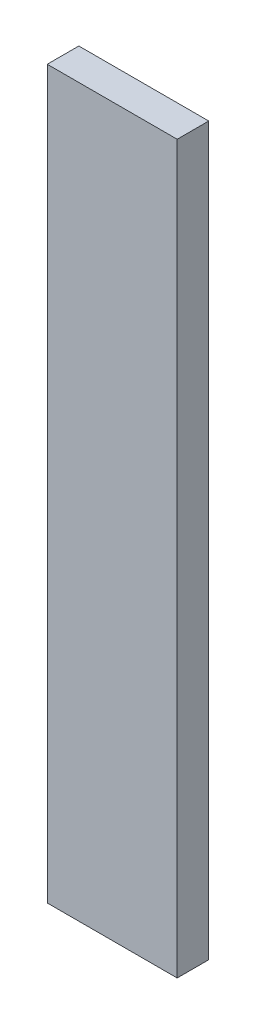
ISO-10303-21;
HEADER;
FILE_DESCRIPTION(('STEP AP214'),'2;1');
FILE_NAME('part.step','',(''),(''),'','','');
FILE_SCHEMA(('AUTOMOTIVE_DESIGN { 1 0 10303 214 1 1 1 1 }'));
ENDSEC;
DATA;
#1=APPLICATION_CONTEXT('core data for automotive mechanical design processes');
#2=APPLICATION_PROTOCOL_DEFINITION('international standard','automotive_design',2000,#1);
#3=PRODUCT_CONTEXT('',#1,'mechanical');
#4=PRODUCT('Part','Part','',(#3));
#5=PRODUCT_RELATED_PRODUCT_CATEGORY('part','',(#4));
#6=PRODUCT_DEFINITION_FORMATION('','',#4);
#7=PRODUCT_DEFINITION_CONTEXT('part definition',#1,'design');
#8=PRODUCT_DEFINITION('design','',#6,#7);
#9=PRODUCT_DEFINITION_SHAPE('','',#8);
#10=(LENGTH_UNIT() NAMED_UNIT(*) SI_UNIT(.MILLI.,.METRE.));
#11=(NAMED_UNIT(*) PLANE_ANGLE_UNIT() SI_UNIT($,.RADIAN.));
#12=(NAMED_UNIT(*) SI_UNIT($,.STERADIAN.) SOLID_ANGLE_UNIT());
#13=UNCERTAINTY_MEASURE_WITH_UNIT(LENGTH_MEASURE(1.E-05),#10,'distance_accuracy_value','');
#14=(GEOMETRIC_REPRESENTATION_CONTEXT(3) GLOBAL_UNCERTAINTY_ASSIGNED_CONTEXT((#13)) GLOBAL_UNIT_ASSIGNED_CONTEXT((#10,
#11,#12)) REPRESENTATION_CONTEXT('',''));
#15=CARTESIAN_POINT('',(0.,0.,0.));
#16=DIRECTION('',(0.,0.,1.));
#17=DIRECTION('',(1.,0.,0.));
#18=AXIS2_PLACEMENT_3D('',#15,#16,#17);
#19=CARTESIAN_POINT('',(0.,-506.,22.));
#20=DIRECTION('',(0.,1.,0.));
#21=DIRECTION('',(0.,0.,1.));
#22=AXIS2_PLACEMENT_3D('',#19,#20,#21);
#23=PLANE('',#22);
#24=DIRECTION('',(1.,0.,0.));
#25=VECTOR('',#24,1.);
#26=CARTESIAN_POINT('',(0.,-506.,0.));
#27=LINE('',#26,#25);
#28=CARTESIAN_POINT('',(0.,-506.,0.));
#29=VERTEX_POINT('',#28);
#30=CARTESIAN_POINT('',(90.4999999999996,-506.,0.));
#31=VERTEX_POINT('',#30);
#32=EDGE_CURVE('E141',#29,#31,#27,.T.);
#33=ORIENTED_EDGE('',*,*,#32,.T.);
#34=DIRECTION('',(0.,0.,-1.));
#35=VECTOR('',#34,1.);
#36=CARTESIAN_POINT('',(90.4999999999996,-506.,22.));
#37=LINE('',#36,#35);
#38=CARTESIAN_POINT('',(90.4999999999996,-506.,22.));
#39=VERTEX_POINT('',#38);
#40=EDGE_CURVE('E11',#39,#31,#37,.T.);
#41=ORIENTED_EDGE('',*,*,#40,.F.);
#42=DIRECTION('',(1.,0.,0.));
#43=VECTOR('',#42,1.);
#44=CARTESIAN_POINT('',(0.,-506.,22.));
#45=LINE('',#44,#43);
#46=CARTESIAN_POINT('',(0.,-506.,22.));
#47=VERTEX_POINT('',#46);
#48=EDGE_CURVE('E133',#47,#39,#45,.T.);
#49=ORIENTED_EDGE('',*,*,#48,.F.);
#50=DIRECTION('',(0.,0.,-1.));
#51=VECTOR('',#50,1.);
#52=CARTESIAN_POINT('',(0.,-506.,22.));
#53=LINE('',#52,#51);
#54=EDGE_CURVE('E57',#47,#29,#53,.T.);
#55=ORIENTED_EDGE('',*,*,#54,.T.);
#56=EDGE_LOOP('',(#33,#41,#49,#55));
#57=FACE_BOUND('',#56,.T.);
#58=ADVANCED_FACE('F34',(#57),#23,.F.);
#59=CARTESIAN_POINT('',(90.4999999999996,-506.,22.));
#60=DIRECTION('',(-1.,0.,0.));
#61=DIRECTION('',(0.,0.,1.));
#62=AXIS2_PLACEMENT_3D('',#59,#60,#61);
#63=PLANE('',#62);
#64=DIRECTION('',(0.,1.,0.));
#65=VECTOR('',#64,1.);
#66=CARTESIAN_POINT('',(90.4999999999996,-506.,0.));
#67=LINE('',#66,#65);
#68=CARTESIAN_POINT('',(90.4999999999996,1.11022302462516E-13,0.));
#69=VERTEX_POINT('',#68);
#70=EDGE_CURVE('E143',#31,#69,#67,.T.);
#71=ORIENTED_EDGE('',*,*,#70,.T.);
#72=DIRECTION('',(0.,0.,-1.));
#73=VECTOR('',#72,1.);
#74=CARTESIAN_POINT('',(90.4999999999996,1.11022302462516E-13,22.));
#75=LINE('',#74,#73);
#76=CARTESIAN_POINT('',(90.4999999999996,1.11022302462516E-13,22.));
#77=VERTEX_POINT('',#76);
#78=EDGE_CURVE('E41',#77,#69,#75,.T.);
#79=ORIENTED_EDGE('',*,*,#78,.F.);
#80=DIRECTION('',(0.,1.,0.));
#81=VECTOR('',#80,1.);
#82=CARTESIAN_POINT('',(90.4999999999996,-506.,22.));
#83=LINE('',#82,#81);
#84=EDGE_CURVE('E83',#39,#77,#83,.T.);
#85=ORIENTED_EDGE('',*,*,#84,.F.);
#86=ORIENTED_EDGE('',*,*,#40,.T.);
#87=EDGE_LOOP('',(#71,#79,#85,#86));
#88=FACE_BOUND('',#87,.T.);
#89=ADVANCED_FACE('F159',(#88),#63,.F.);
#90=CARTESIAN_POINT('',(0.,0.,22.));
#91=DIRECTION('',(0.,1.,0.));
#92=DIRECTION('',(-1.,0.,0.));
#93=AXIS2_PLACEMENT_3D('',#90,#91,#92);
#94=PLANE('',#93);
#95=DIRECTION('',(1.,0.,0.));
#96=VECTOR('',#95,1.);
#97=CARTESIAN_POINT('',(0.,0.,0.));
#98=LINE('',#97,#96);
#99=CARTESIAN_POINT('',(0.,0.,0.));
#100=VERTEX_POINT('',#99);
#101=EDGE_CURVE('E147',#100,#69,#98,.T.);
#102=ORIENTED_EDGE('',*,*,#101,.F.);
#103=DIRECTION('',(0.,0.,-1.));
#104=VECTOR('',#103,1.);
#105=CARTESIAN_POINT('',(0.,0.,22.));
#106=LINE('',#105,#104);
#107=CARTESIAN_POINT('',(0.,0.,22.));
#108=VERTEX_POINT('',#107);
#109=EDGE_CURVE('E153',#108,#100,#106,.T.);
#110=ORIENTED_EDGE('',*,*,#109,.F.);
#111=DIRECTION('',(1.,0.,0.));
#112=VECTOR('',#111,1.);
#113=CARTESIAN_POINT('',(0.,0.,22.));
#114=LINE('',#113,#112);
#115=EDGE_CURVE('E136',#108,#77,#114,.T.);
#116=ORIENTED_EDGE('',*,*,#115,.T.);
#117=ORIENTED_EDGE('',*,*,#78,.T.);
#118=EDGE_LOOP('',(#102,#110,#116,#117));
#119=FACE_BOUND('',#118,.T.);
#120=ADVANCED_FACE('F157',(#119),#94,.T.);
#121=CARTESIAN_POINT('',(0.,-506.,22.));
#122=DIRECTION('',(-1.,0.,0.));
#123=DIRECTION('',(0.,0.,1.));
#124=AXIS2_PLACEMENT_3D('',#121,#122,#123);
#125=PLANE('',#124);
#126=DIRECTION('',(0.,0.,-1.));
#127=VECTOR('',#126,1.);
#128=CARTESIAN_POINT('',(0.,-9.9999999999999,4.44089209850063E-13));
#129=LINE('',#128,#127);
#130=CARTESIAN_POINT('',(0.,-9.9999999999999,12.));
#131=VERTEX_POINT('',#130);
#132=CARTESIAN_POINT('',(0.,-9.9999999999999,4.44089209850063E-13));
#133=VERTEX_POINT('',#132);
#134=EDGE_CURVE('E122',#131,#133,#129,.T.);
#135=ORIENTED_EDGE('',*,*,#134,.F.);
#136=DIRECTION('',(0.,1.,0.));
#137=VECTOR('',#136,1.);
#138=CARTESIAN_POINT('',(0.,-9.9999999999999,12.));
#139=LINE('',#138,#137);
#140=CARTESIAN_POINT('',(0.,-496.,12.0000000000001));
#141=VERTEX_POINT('',#140);
#142=EDGE_CURVE('E170',#141,#131,#139,.T.);
#143=ORIENTED_EDGE('',*,*,#142,.F.);
#144=DIRECTION('',(0.,0.,1.));
#145=VECTOR('',#144,1.);
#146=CARTESIAN_POINT('',(0.,-496.,0.));
#147=LINE('',#146,#145);
#148=CARTESIAN_POINT('',(0.,-496.,0.));
#149=VERTEX_POINT('',#148);
#150=EDGE_CURVE('E168',#149,#141,#147,.T.);
#151=ORIENTED_EDGE('',*,*,#150,.F.);
#152=DIRECTION('',(0.,1.,0.));
#153=VECTOR('',#152,1.);
#154=CARTESIAN_POINT('',(0.,-506.,0.));
#155=LINE('',#154,#153);
#156=EDGE_CURVE('E126',#29,#149,#155,.T.);
#157=ORIENTED_EDGE('',*,*,#156,.F.);
#158=ORIENTED_EDGE('',*,*,#54,.F.);
#159=DIRECTION('',(0.,1.,0.));
#160=VECTOR('',#159,1.);
#161=CARTESIAN_POINT('',(0.,-506.,22.));
#162=LINE('',#161,#160);
#163=EDGE_CURVE('E139',#47,#108,#162,.T.);
#164=ORIENTED_EDGE('',*,*,#163,.T.);
#165=ORIENTED_EDGE('',*,*,#109,.T.);
#166=EDGE_CURVE('E150',#133,#100,#155,.T.);
#167=ORIENTED_EDGE('',*,*,#166,.F.);
#168=EDGE_LOOP('',(#135,#143,#151,#157,#158,#164,#165,#167));
#169=FACE_BOUND('',#168,.T.);
#170=ADVANCED_FACE('F163',(#169),#125,.T.);
#171=CARTESIAN_POINT('',(0.,0.,22.));
#172=DIRECTION('',(0.,0.,1.));
#173=DIRECTION('',(1.,0.,0.));
#174=AXIS2_PLACEMENT_3D('',#171,#172,#173);
#175=PLANE('',#174);
#176=ORIENTED_EDGE('',*,*,#48,.T.);
#177=ORIENTED_EDGE('',*,*,#84,.T.);
#178=ORIENTED_EDGE('',*,*,#115,.F.);
#179=ORIENTED_EDGE('',*,*,#163,.F.);
#180=EDGE_LOOP('',(#176,#177,#178,#179));
#181=FACE_BOUND('',#180,.T.);
#182=ADVANCED_FACE('F166',(#181),#175,.T.);
#183=CARTESIAN_POINT('',(0.,0.,0.));
#184=DIRECTION('',(0.,0.,1.));
#185=DIRECTION('',(1.,0.,0.));
#186=AXIS2_PLACEMENT_3D('',#183,#184,#185);
#187=PLANE('',#186);
#188=DIRECTION('',(0.,-1.,0.));
#189=VECTOR('',#188,1.);
#190=CARTESIAN_POINT('',(7.,-9.9999999999999,4.44089209850063E-13));
#191=LINE('',#190,#189);
#192=CARTESIAN_POINT('',(7.,-9.9999999999999,0.));
#193=VERTEX_POINT('',#192);
#194=CARTESIAN_POINT('',(7.,-496.,0.));
#195=VERTEX_POINT('',#194);
#196=EDGE_CURVE('E116',#193,#195,#191,.T.);
#197=ORIENTED_EDGE('',*,*,#196,.F.);
#198=DIRECTION('',(-1.,0.,0.));
#199=VECTOR('',#198,1.);
#200=CARTESIAN_POINT('',(7.,-9.9999999999999,4.44089209850063E-13));
#201=LINE('',#200,#199);
#202=EDGE_CURVE('E144',#193,#133,#201,.T.);
#203=ORIENTED_EDGE('',*,*,#202,.T.);
#204=ORIENTED_EDGE('',*,*,#166,.T.);
#205=ORIENTED_EDGE('',*,*,#101,.T.);
#206=ORIENTED_EDGE('',*,*,#70,.F.);
#207=ORIENTED_EDGE('',*,*,#32,.F.);
#208=ORIENTED_EDGE('',*,*,#156,.T.);
#209=DIRECTION('',(-1.,0.,0.));
#210=VECTOR('',#209,1.);
#211=CARTESIAN_POINT('',(7.,-496.,0.));
#212=LINE('',#211,#210);
#213=EDGE_CURVE('E111',#195,#149,#212,.T.);
#214=ORIENTED_EDGE('',*,*,#213,.F.);
#215=EDGE_LOOP('',(#197,#203,#204,#205,#206,#207,#208,#214));
#216=FACE_BOUND('',#215,.T.);
#217=ADVANCED_FACE('F125',(#216),#187,.F.);
#218=CARTESIAN_POINT('',(7.,-9.9999999999999,4.44089209850063E-13));
#219=DIRECTION('',(0.,1.,0.));
#220=DIRECTION('',(0.,0.,1.));
#221=AXIS2_PLACEMENT_3D('',#218,#219,#220);
#222=PLANE('',#221);
#223=ORIENTED_EDGE('',*,*,#134,.T.);
#224=ORIENTED_EDGE('',*,*,#202,.F.);
#225=DIRECTION('',(0.,0.,-1.));
#226=VECTOR('',#225,1.);
#227=CARTESIAN_POINT('',(7.,-9.9999999999999,4.44089209850063E-13));
#228=LINE('',#227,#226);
#229=CARTESIAN_POINT('',(7.,-9.9999999999999,12.));
#230=VERTEX_POINT('',#229);
#231=EDGE_CURVE('E48',#230,#193,#228,.T.);
#232=ORIENTED_EDGE('',*,*,#231,.F.);
#233=DIRECTION('',(-1.,0.,0.));
#234=VECTOR('',#233,1.);
#235=CARTESIAN_POINT('',(7.,-9.9999999999999,12.));
#236=LINE('',#235,#234);
#237=EDGE_CURVE('E128',#230,#131,#236,.T.);
#238=ORIENTED_EDGE('',*,*,#237,.T.);
#239=EDGE_LOOP('',(#223,#224,#232,#238));
#240=FACE_BOUND('',#239,.T.);
#241=ADVANCED_FACE('F177',(#240),#222,.F.);
#242=CARTESIAN_POINT('',(7.,-9.9999999999999,12.));
#243=DIRECTION('',(0.,0.,1.));
#244=DIRECTION('',(0.,-1.,0.));
#245=AXIS2_PLACEMENT_3D('',#242,#243,#244);
#246=PLANE('',#245);
#247=ORIENTED_EDGE('',*,*,#142,.T.);
#248=ORIENTED_EDGE('',*,*,#237,.F.);
#249=DIRECTION('',(0.,1.,0.));
#250=VECTOR('',#249,1.);
#251=CARTESIAN_POINT('',(7.,-9.9999999999999,12.));
#252=LINE('',#251,#250);
#253=CARTESIAN_POINT('',(7.,-496.,12.0000000000001));
#254=VERTEX_POINT('',#253);
#255=EDGE_CURVE('E115',#254,#230,#252,.T.);
#256=ORIENTED_EDGE('',*,*,#255,.F.);
#257=DIRECTION('',(-1.,0.,0.));
#258=VECTOR('',#257,1.);
#259=CARTESIAN_POINT('',(7.,-496.,12.0000000000001));
#260=LINE('',#259,#258);
#261=EDGE_CURVE('E113',#254,#141,#260,.T.);
#262=ORIENTED_EDGE('',*,*,#261,.T.);
#263=EDGE_LOOP('',(#247,#248,#256,#262));
#264=FACE_BOUND('',#263,.T.);
#265=ADVANCED_FACE('F179',(#264),#246,.F.);
#266=CARTESIAN_POINT('',(7.,-496.,0.));
#267=DIRECTION('',(0.,-1.,0.));
#268=DIRECTION('',(0.,0.,-1.));
#269=AXIS2_PLACEMENT_3D('',#266,#267,#268);
#270=PLANE('',#269);
#271=ORIENTED_EDGE('',*,*,#150,.T.);
#272=ORIENTED_EDGE('',*,*,#261,.F.);
#273=DIRECTION('',(0.,0.,1.));
#274=VECTOR('',#273,1.);
#275=CARTESIAN_POINT('',(7.,-496.,0.));
#276=LINE('',#275,#274);
#277=EDGE_CURVE('E107',#195,#254,#276,.T.);
#278=ORIENTED_EDGE('',*,*,#277,.F.);
#279=ORIENTED_EDGE('',*,*,#213,.T.);
#280=EDGE_LOOP('',(#271,#272,#278,#279));
#281=FACE_BOUND('',#280,.T.);
#282=ADVANCED_FACE('F109',(#281),#270,.F.);
#283=CARTESIAN_POINT('',(7.,0.,0.));
#284=DIRECTION('',(-1.,0.,0.));
#285=DIRECTION('',(0.,0.,1.));
#286=AXIS2_PLACEMENT_3D('',#283,#284,#285);
#287=PLANE('',#286);
#288=ORIENTED_EDGE('',*,*,#196,.T.);
#289=ORIENTED_EDGE('',*,*,#277,.T.);
#290=ORIENTED_EDGE('',*,*,#255,.T.);
#291=ORIENTED_EDGE('',*,*,#231,.T.);
#292=EDGE_LOOP('',(#288,#289,#290,#291));
#293=FACE_BOUND('',#292,.T.);
#294=ADVANCED_FACE('F119',(#293),#287,.T.);
#295=CLOSED_SHELL('',(#58,#89,#120,#170,#182,#217,#241,#265,#282,#294));
#296=MANIFOLD_SOLID_BREP('B2',#295);
#297=ADVANCED_BREP_SHAPE_REPRESENTATION('',(#18,#296),#14);
#298=SHAPE_DEFINITION_REPRESENTATION(#9,#297);
ENDSEC;
END-ISO-10303-21;
